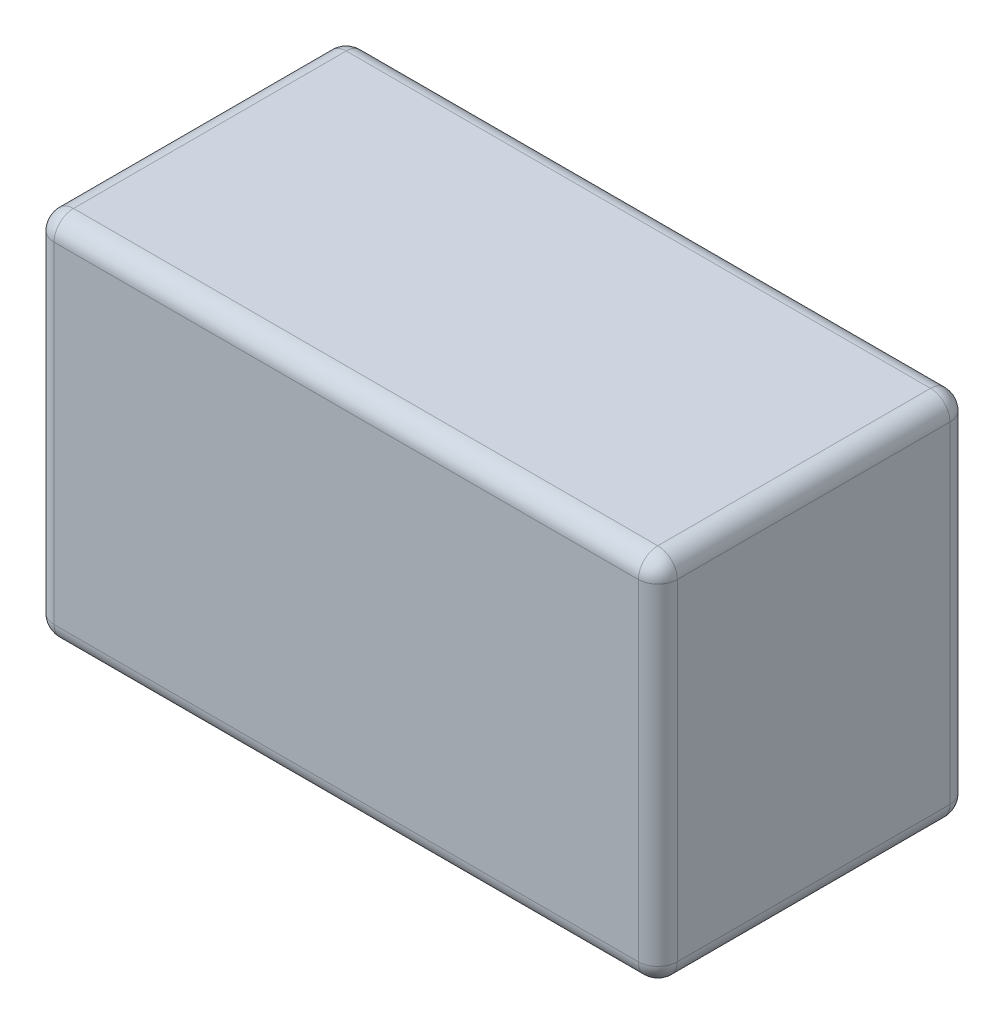
ISO-10303-21;
HEADER;
FILE_DESCRIPTION(('STEP AP214'),'2;1');
FILE_NAME('part.step','',(''),(''),'','','');
FILE_SCHEMA(('AUTOMOTIVE_DESIGN { 1 0 10303 214 1 1 1 1 }'));
ENDSEC;
DATA;
#1=APPLICATION_CONTEXT('core data for automotive mechanical design processes');
#2=APPLICATION_PROTOCOL_DEFINITION('international standard','automotive_design',2000,#1);
#3=PRODUCT_CONTEXT('',#1,'mechanical');
#4=PRODUCT('Part','Part','',(#3));
#5=PRODUCT_RELATED_PRODUCT_CATEGORY('part','',(#4));
#6=PRODUCT_DEFINITION_FORMATION('','',#4);
#7=PRODUCT_DEFINITION_CONTEXT('part definition',#1,'design');
#8=PRODUCT_DEFINITION('design','',#6,#7);
#9=PRODUCT_DEFINITION_SHAPE('','',#8);
#10=(LENGTH_UNIT() NAMED_UNIT(*) SI_UNIT(.MILLI.,.METRE.));
#11=(NAMED_UNIT(*) PLANE_ANGLE_UNIT() SI_UNIT($,.RADIAN.));
#12=(NAMED_UNIT(*) SI_UNIT($,.STERADIAN.) SOLID_ANGLE_UNIT());
#13=UNCERTAINTY_MEASURE_WITH_UNIT(LENGTH_MEASURE(1.E-05),#10,'distance_accuracy_value','');
#14=(GEOMETRIC_REPRESENTATION_CONTEXT(3) GLOBAL_UNCERTAINTY_ASSIGNED_CONTEXT((#13)) GLOBAL_UNIT_ASSIGNED_CONTEXT((#10,
#11,#12)) REPRESENTATION_CONTEXT('',''));
#15=CARTESIAN_POINT('',(0.,0.,0.));
#16=DIRECTION('',(0.,0.,1.));
#17=DIRECTION('',(1.,0.,0.));
#18=AXIS2_PLACEMENT_3D('',#15,#16,#17);
#19=CARTESIAN_POINT('',(0.75,0.9,0.35));
#20=DIRECTION('',(1.,0.,0.));
#21=DIRECTION('',(0.,0.,-1.));
#22=AXIS2_PLACEMENT_3D('',#19,#20,#21);
#23=SPHERICAL_SURFACE('',#22,0.05);
#24=CARTESIAN_POINT('',(0.75,0.9,0.35));
#25=DIRECTION('',(0.,-1.,0.));
#26=DIRECTION('',(0.,0.,-1.));
#27=AXIS2_PLACEMENT_3D('',#24,#25,#26);
#28=CIRCLE('',#27,0.05);
#29=CARTESIAN_POINT('',(0.8,0.9,0.35));
#30=VERTEX_POINT('',#29);
#31=CARTESIAN_POINT('',(0.75,0.9,0.4));
#32=VERTEX_POINT('',#31);
#33=EDGE_CURVE('E122',#30,#32,#28,.T.);
#34=ORIENTED_EDGE('',*,*,#33,.F.);
#35=CARTESIAN_POINT('',(0.75,0.9,0.35));
#36=DIRECTION('',(0.,0.,-1.));
#37=DIRECTION('',(-1.,0.,0.));
#38=AXIS2_PLACEMENT_3D('',#35,#36,#37);
#39=CIRCLE('',#38,0.05);
#40=CARTESIAN_POINT('',(0.75,0.95,0.35));
#41=VERTEX_POINT('',#40);
#42=EDGE_CURVE('E131',#41,#30,#39,.T.);
#43=ORIENTED_EDGE('',*,*,#42,.F.);
#44=CARTESIAN_POINT('',(0.75,0.9,0.35));
#45=DIRECTION('',(1.,0.,0.));
#46=DIRECTION('',(0.,0.,-1.));
#47=AXIS2_PLACEMENT_3D('',#44,#45,#46);
#48=CIRCLE('',#47,0.05);
#49=EDGE_CURVE('E111',#32,#41,#48,.F.);
#50=ORIENTED_EDGE('',*,*,#49,.F.);
#51=EDGE_LOOP('',(#34,#43,#50));
#52=FACE_BOUND('',#51,.T.);
#53=ADVANCED_FACE('F17',(#52),#23,.T.);
#54=CARTESIAN_POINT('',(-0.75,0.9,0.35));
#55=DIRECTION('',(1.,0.,0.));
#56=DIRECTION('',(0.,0.,-1.));
#57=AXIS2_PLACEMENT_3D('',#54,#55,#56);
#58=SPHERICAL_SURFACE('',#57,0.05);
#59=CARTESIAN_POINT('',(-0.75,0.9,0.35));
#60=DIRECTION('',(0.,-1.,0.));
#61=DIRECTION('',(0.,0.,-1.));
#62=AXIS2_PLACEMENT_3D('',#59,#60,#61);
#63=CIRCLE('',#62,0.05);
#64=CARTESIAN_POINT('',(-0.75,0.9,0.4));
#65=VERTEX_POINT('',#64);
#66=CARTESIAN_POINT('',(-0.8,0.9,0.35));
#67=VERTEX_POINT('',#66);
#68=EDGE_CURVE('E264',#65,#67,#63,.T.);
#69=ORIENTED_EDGE('',*,*,#68,.F.);
#70=CARTESIAN_POINT('',(-0.75,0.9,0.35));
#71=DIRECTION('',(1.,0.,0.));
#72=DIRECTION('',(0.,0.,-1.));
#73=AXIS2_PLACEMENT_3D('',#70,#71,#72);
#74=CIRCLE('',#73,0.05);
#75=CARTESIAN_POINT('',(-0.75,0.95,0.35));
#76=VERTEX_POINT('',#75);
#77=EDGE_CURVE('E114',#76,#65,#74,.T.);
#78=ORIENTED_EDGE('',*,*,#77,.F.);
#79=CARTESIAN_POINT('',(-0.75,0.9,0.35));
#80=DIRECTION('',(0.,0.,1.));
#81=DIRECTION('',(1.,0.,0.));
#82=AXIS2_PLACEMENT_3D('',#79,#80,#81);
#83=CIRCLE('',#82,0.05);
#84=EDGE_CURVE('E255',#67,#76,#83,.F.);
#85=ORIENTED_EDGE('',*,*,#84,.F.);
#86=EDGE_LOOP('',(#69,#78,#85));
#87=FACE_BOUND('',#86,.T.);
#88=ADVANCED_FACE('F151',(#87),#58,.T.);
#89=CARTESIAN_POINT('',(-0.75,0.05,0.35));
#90=DIRECTION('',(1.,0.,0.));
#91=DIRECTION('',(0.,0.,-1.));
#92=AXIS2_PLACEMENT_3D('',#89,#90,#91);
#93=SPHERICAL_SURFACE('',#92,0.05);
#94=CARTESIAN_POINT('',(-0.75,0.05,0.35));
#95=DIRECTION('',(0.,-1.,0.));
#96=DIRECTION('',(0.,0.,-1.));
#97=AXIS2_PLACEMENT_3D('',#94,#95,#96);
#98=CIRCLE('',#97,0.05);
#99=CARTESIAN_POINT('',(-0.8,0.05,0.35));
#100=VERTEX_POINT('',#99);
#101=CARTESIAN_POINT('',(-0.75,0.05,0.4));
#102=VERTEX_POINT('',#101);
#103=EDGE_CURVE('E261',#100,#102,#98,.F.);
#104=ORIENTED_EDGE('',*,*,#103,.F.);
#105=CARTESIAN_POINT('',(-0.75,0.05,0.35));
#106=DIRECTION('',(0.,0.,-1.));
#107=DIRECTION('',(-1.,0.,0.));
#108=AXIS2_PLACEMENT_3D('',#105,#106,#107);
#109=CIRCLE('',#108,0.05);
#110=CARTESIAN_POINT('',(-0.75,0.,0.35));
#111=VERTEX_POINT('',#110);
#112=EDGE_CURVE('E253',#111,#100,#109,.T.);
#113=ORIENTED_EDGE('',*,*,#112,.F.);
#114=CARTESIAN_POINT('',(-0.75,0.05,0.35));
#115=DIRECTION('',(-1.,0.,0.));
#116=DIRECTION('',(0.,0.,1.));
#117=AXIS2_PLACEMENT_3D('',#114,#115,#116);
#118=CIRCLE('',#117,0.05);
#119=EDGE_CURVE('E247',#102,#111,#118,.F.);
#120=ORIENTED_EDGE('',*,*,#119,.F.);
#121=EDGE_LOOP('',(#104,#113,#120));
#122=FACE_BOUND('',#121,.T.);
#123=ADVANCED_FACE('F147',(#122),#93,.T.);
#124=CARTESIAN_POINT('',(0.75,0.05,0.35));
#125=DIRECTION('',(1.,0.,0.));
#126=DIRECTION('',(0.,0.,-1.));
#127=AXIS2_PLACEMENT_3D('',#124,#125,#126);
#128=SPHERICAL_SURFACE('',#127,0.05);
#129=CARTESIAN_POINT('',(0.75,0.05,0.35));
#130=DIRECTION('',(-1.,0.,0.));
#131=DIRECTION('',(0.,0.,1.));
#132=AXIS2_PLACEMENT_3D('',#129,#130,#131);
#133=CIRCLE('',#132,0.05);
#134=CARTESIAN_POINT('',(0.75,0.,0.35));
#135=VERTEX_POINT('',#134);
#136=CARTESIAN_POINT('',(0.75,0.050000000000006,0.4));
#137=VERTEX_POINT('',#136);
#138=EDGE_CURVE('E245',#135,#137,#133,.T.);
#139=ORIENTED_EDGE('',*,*,#138,.F.);
#140=CARTESIAN_POINT('',(0.75,0.05,0.35));
#141=DIRECTION('',(0.,0.,1.));
#142=DIRECTION('',(1.,0.,0.));
#143=AXIS2_PLACEMENT_3D('',#140,#141,#142);
#144=CIRCLE('',#143,0.05);
#145=CARTESIAN_POINT('',(0.8,0.05,0.35));
#146=VERTEX_POINT('',#145);
#147=EDGE_CURVE('E250',#146,#135,#144,.F.);
#148=ORIENTED_EDGE('',*,*,#147,.F.);
#149=CARTESIAN_POINT('',(0.75,0.05,0.35));
#150=DIRECTION('',(0.,-1.,0.));
#151=DIRECTION('',(0.,0.,-1.));
#152=AXIS2_PLACEMENT_3D('',#149,#150,#151);
#153=CIRCLE('',#152,0.05);
#154=EDGE_CURVE('E133',#137,#146,#153,.F.);
#155=ORIENTED_EDGE('',*,*,#154,.F.);
#156=EDGE_LOOP('',(#139,#148,#155));
#157=FACE_BOUND('',#156,.T.);
#158=ADVANCED_FACE('F143',(#157),#128,.T.);
#159=CARTESIAN_POINT('',(0.75,0.95,0.35));
#160=DIRECTION('',(0.,-1.,0.));
#161=DIRECTION('',(0.,0.,-1.));
#162=AXIS2_PLACEMENT_3D('',#159,#160,#161);
#163=CYLINDRICAL_SURFACE('',#162,0.05);
#164=ORIENTED_EDGE('',*,*,#154,.T.);
#165=DIRECTION('',(0.,1.,0.));
#166=VECTOR('',#165,1.);
#167=CARTESIAN_POINT('',(0.8,0.95,0.35));
#168=LINE('',#167,#166);
#169=EDGE_CURVE('E127',#146,#30,#168,.T.);
#170=ORIENTED_EDGE('',*,*,#169,.T.);
#171=ORIENTED_EDGE('',*,*,#33,.T.);
#172=DIRECTION('',(0.,-1.,0.));
#173=VECTOR('',#172,1.);
#174=CARTESIAN_POINT('',(0.75,0.95,0.4));
#175=LINE('',#174,#173);
#176=EDGE_CURVE('E124',#32,#137,#175,.T.);
#177=ORIENTED_EDGE('',*,*,#176,.T.);
#178=EDGE_LOOP('',(#164,#170,#171,#177));
#179=FACE_BOUND('',#178,.T.);
#180=ADVANCED_FACE('F123',(#179),#163,.T.);
#181=CARTESIAN_POINT('',(0.75,0.9,-0.4));
#182=DIRECTION('',(0.,0.,-1.));
#183=DIRECTION('',(-1.,0.,0.));
#184=AXIS2_PLACEMENT_3D('',#181,#182,#183);
#185=CYLINDRICAL_SURFACE('',#184,0.05);
#186=CARTESIAN_POINT('',(0.75,0.9,-0.35));
#187=DIRECTION('',(0.,0.,1.));
#188=DIRECTION('',(1.,0.,0.));
#189=AXIS2_PLACEMENT_3D('',#186,#187,#188);
#190=CIRCLE('',#189,0.05);
#191=CARTESIAN_POINT('',(0.75,0.95,-0.35));
#192=VERTEX_POINT('',#191);
#193=CARTESIAN_POINT('',(0.8,0.9,-0.35));
#194=VERTEX_POINT('',#193);
#195=EDGE_CURVE('E236',#192,#194,#190,.F.);
#196=ORIENTED_EDGE('',*,*,#195,.F.);
#197=DIRECTION('',(0.,0.,-1.));
#198=VECTOR('',#197,1.);
#199=CARTESIAN_POINT('',(0.75,0.95,-0.4));
#200=LINE('',#199,#198);
#201=EDGE_CURVE('E116',#192,#41,#200,.F.);
#202=ORIENTED_EDGE('',*,*,#201,.T.);
#203=ORIENTED_EDGE('',*,*,#42,.T.);
#204=DIRECTION('',(0.,0.,1.));
#205=VECTOR('',#204,1.);
#206=CARTESIAN_POINT('',(0.8,0.9,0.4));
#207=LINE('',#206,#205);
#208=EDGE_CURVE('E117',#30,#194,#207,.F.);
#209=ORIENTED_EDGE('',*,*,#208,.T.);
#210=EDGE_LOOP('',(#196,#202,#203,#209));
#211=FACE_BOUND('',#210,.T.);
#212=ADVANCED_FACE('F269',(#211),#185,.T.);
#213=CARTESIAN_POINT('',(-0.75,0.95,0.35));
#214=DIRECTION('',(0.,-1.,0.));
#215=DIRECTION('',(0.,0.,-1.));
#216=AXIS2_PLACEMENT_3D('',#213,#214,#215);
#217=CYLINDRICAL_SURFACE('',#216,0.05);
#218=ORIENTED_EDGE('',*,*,#103,.T.);
#219=DIRECTION('',(0.,-1.,0.));
#220=VECTOR('',#219,1.);
#221=CARTESIAN_POINT('',(-0.75,0.95,0.4));
#222=LINE('',#221,#220);
#223=EDGE_CURVE('E258',#102,#65,#222,.F.);
#224=ORIENTED_EDGE('',*,*,#223,.T.);
#225=ORIENTED_EDGE('',*,*,#68,.T.);
#226=DIRECTION('',(0.,1.,0.));
#227=VECTOR('',#226,1.);
#228=CARTESIAN_POINT('',(-0.8,0.95,0.35));
#229=LINE('',#228,#227);
#230=EDGE_CURVE('E353',#67,#100,#229,.F.);
#231=ORIENTED_EDGE('',*,*,#230,.T.);
#232=EDGE_LOOP('',(#218,#224,#225,#231));
#233=FACE_BOUND('',#232,.T.);
#234=ADVANCED_FACE('F358',(#233),#217,.T.);
#235=CARTESIAN_POINT('',(-0.75,0.9,-0.4));
#236=DIRECTION('',(0.,0.,1.));
#237=DIRECTION('',(1.,0.,0.));
#238=AXIS2_PLACEMENT_3D('',#235,#236,#237);
#239=CYLINDRICAL_SURFACE('',#238,0.05);
#240=CARTESIAN_POINT('',(-0.75,0.9,-0.35));
#241=DIRECTION('',(0.,3.83299520255585E-12,1.));
#242=DIRECTION('',(1.,0.,0.));
#243=AXIS2_PLACEMENT_3D('',#240,#241,#242);
#244=CIRCLE('',#243,0.05);
#245=CARTESIAN_POINT('',(-0.8,0.9,-0.35));
#246=VERTEX_POINT('',#245);
#247=CARTESIAN_POINT('',(-0.75,0.95,-0.350000000000024));
#248=VERTEX_POINT('',#247);
#249=EDGE_CURVE('E213',#246,#248,#244,.F.);
#250=ORIENTED_EDGE('',*,*,#249,.F.);
#251=DIRECTION('',(0.,0.,-1.));
#252=VECTOR('',#251,1.);
#253=CARTESIAN_POINT('',(-0.8,0.9,0.4));
#254=LINE('',#253,#252);
#255=EDGE_CURVE('E355',#246,#67,#254,.F.);
#256=ORIENTED_EDGE('',*,*,#255,.T.);
#257=ORIENTED_EDGE('',*,*,#84,.T.);
#258=DIRECTION('',(0.,0.,-1.));
#259=VECTOR('',#258,1.);
#260=CARTESIAN_POINT('',(-0.75,0.95,-0.4));
#261=LINE('',#260,#259);
#262=EDGE_CURVE('E234',#76,#248,#261,.T.);
#263=ORIENTED_EDGE('',*,*,#262,.T.);
#264=EDGE_LOOP('',(#250,#256,#257,#263));
#265=FACE_BOUND('',#264,.T.);
#266=ADVANCED_FACE('F361',(#265),#239,.T.);
#267=CARTESIAN_POINT('',(-0.75,0.05,0.4));
#268=DIRECTION('',(0.,0.,-1.));
#269=DIRECTION('',(-1.,0.,0.));
#270=AXIS2_PLACEMENT_3D('',#267,#268,#269);
#271=CYLINDRICAL_SURFACE('',#270,0.05);
#272=CARTESIAN_POINT('',(-0.75,0.05,-0.35));
#273=DIRECTION('',(0.,0.,-1.));
#274=DIRECTION('',(1.,0.,0.));
#275=AXIS2_PLACEMENT_3D('',#272,#273,#274);
#276=CIRCLE('',#275,0.05);
#277=CARTESIAN_POINT('',(-0.75,0.,-0.35));
#278=VERTEX_POINT('',#277);
#279=CARTESIAN_POINT('',(-0.8,0.05,-0.35));
#280=VERTEX_POINT('',#279);
#281=EDGE_CURVE('E209',#278,#280,#276,.T.);
#282=ORIENTED_EDGE('',*,*,#281,.F.);
#283=DIRECTION('',(0.,0.,-1.));
#284=VECTOR('',#283,1.);
#285=CARTESIAN_POINT('',(-0.75,0.,-0.4));
#286=LINE('',#285,#284);
#287=EDGE_CURVE('E205',#111,#278,#286,.T.);
#288=ORIENTED_EDGE('',*,*,#287,.F.);
#289=ORIENTED_EDGE('',*,*,#112,.T.);
#290=DIRECTION('',(0.,0.,-1.));
#291=VECTOR('',#290,1.);
#292=CARTESIAN_POINT('',(-0.8,0.05,0.4));
#293=LINE('',#292,#291);
#294=EDGE_CURVE('E307',#100,#280,#293,.T.);
#295=ORIENTED_EDGE('',*,*,#294,.T.);
#296=EDGE_LOOP('',(#282,#288,#289,#295));
#297=FACE_BOUND('',#296,.T.);
#298=ADVANCED_FACE('F305',(#297),#271,.T.);
#299=CARTESIAN_POINT('',(0.75,0.05,0.4));
#300=DIRECTION('',(0.,0.,1.));
#301=DIRECTION('',(1.,0.,0.));
#302=AXIS2_PLACEMENT_3D('',#299,#300,#301);
#303=CYLINDRICAL_SURFACE('',#302,0.05);
#304=CARTESIAN_POINT('',(0.75,0.05,-0.35));
#305=DIRECTION('',(0.,0.,-1.));
#306=DIRECTION('',(1.,0.,0.));
#307=AXIS2_PLACEMENT_3D('',#304,#305,#306);
#308=CIRCLE('',#307,0.05);
#309=CARTESIAN_POINT('',(0.8,0.05,-0.35));
#310=VERTEX_POINT('',#309);
#311=CARTESIAN_POINT('',(0.75,0.,-0.35));
#312=VERTEX_POINT('',#311);
#313=EDGE_CURVE('E207',#310,#312,#308,.T.);
#314=ORIENTED_EDGE('',*,*,#313,.F.);
#315=DIRECTION('',(0.,0.,1.));
#316=VECTOR('',#315,1.);
#317=CARTESIAN_POINT('',(0.8,0.05,0.4));
#318=LINE('',#317,#316);
#319=EDGE_CURVE('E242',#310,#146,#318,.T.);
#320=ORIENTED_EDGE('',*,*,#319,.T.);
#321=ORIENTED_EDGE('',*,*,#147,.T.);
#322=DIRECTION('',(0.,0.,-1.));
#323=VECTOR('',#322,1.);
#324=CARTESIAN_POINT('',(0.75,0.,-0.4));
#325=LINE('',#324,#323);
#326=EDGE_CURVE('E294',#312,#135,#325,.F.);
#327=ORIENTED_EDGE('',*,*,#326,.F.);
#328=EDGE_LOOP('',(#314,#320,#321,#327));
#329=FACE_BOUND('',#328,.T.);
#330=ADVANCED_FACE('F344',(#329),#303,.T.);
#331=CARTESIAN_POINT('',(-0.8,0.95,0.4));
#332=DIRECTION('',(0.,0.,-1.));
#333=DIRECTION('',(-1.,0.,0.));
#334=AXIS2_PLACEMENT_3D('',#331,#332,#333);
#335=PLANE('',#334);
#336=DIRECTION('',(1.,0.,0.));
#337=VECTOR('',#336,1.);
#338=CARTESIAN_POINT('',(0.8,0.9,0.4));
#339=LINE('',#338,#337);
#340=EDGE_CURVE('E107',#65,#32,#339,.T.);
#341=ORIENTED_EDGE('',*,*,#340,.F.);
#342=ORIENTED_EDGE('',*,*,#223,.F.);
#343=DIRECTION('',(-1.,0.,0.));
#344=VECTOR('',#343,1.);
#345=CARTESIAN_POINT('',(-0.8,0.05,0.4));
#346=LINE('',#345,#344);
#347=EDGE_CURVE('E101',#137,#102,#346,.T.);
#348=ORIENTED_EDGE('',*,*,#347,.F.);
#349=ORIENTED_EDGE('',*,*,#176,.F.);
#350=EDGE_LOOP('',(#341,#342,#348,#349));
#351=FACE_BOUND('',#350,.T.);
#352=ADVANCED_FACE('F135',(#351),#335,.F.);
#353=CARTESIAN_POINT('',(0.8,0.95,0.4));
#354=DIRECTION('',(-1.,0.,0.));
#355=DIRECTION('',(0.,0.,1.));
#356=AXIS2_PLACEMENT_3D('',#353,#354,#355);
#357=PLANE('',#356);
#358=ORIENTED_EDGE('',*,*,#208,.F.);
#359=ORIENTED_EDGE('',*,*,#169,.F.);
#360=ORIENTED_EDGE('',*,*,#319,.F.);
#361=DIRECTION('',(0.,-1.,0.));
#362=VECTOR('',#361,1.);
#363=CARTESIAN_POINT('',(0.8,0.95,-0.35));
#364=LINE('',#363,#362);
#365=EDGE_CURVE('E285',#194,#310,#364,.T.);
#366=ORIENTED_EDGE('',*,*,#365,.F.);
#367=EDGE_LOOP('',(#358,#359,#360,#366));
#368=FACE_BOUND('',#367,.T.);
#369=ADVANCED_FACE('F440',(#368),#357,.F.);
#370=CARTESIAN_POINT('',(0.8,0.9,0.35));
#371=DIRECTION('',(1.,0.,0.));
#372=DIRECTION('',(0.,0.,-1.));
#373=AXIS2_PLACEMENT_3D('',#370,#371,#372);
#374=CYLINDRICAL_SURFACE('',#373,0.05);
#375=ORIENTED_EDGE('',*,*,#340,.T.);
#376=ORIENTED_EDGE('',*,*,#49,.T.);
#377=DIRECTION('',(1.,0.,0.));
#378=VECTOR('',#377,1.);
#379=CARTESIAN_POINT('',(0.8,0.95,0.35));
#380=LINE('',#379,#378);
#381=EDGE_CURVE('E276',#41,#76,#380,.F.);
#382=ORIENTED_EDGE('',*,*,#381,.T.);
#383=ORIENTED_EDGE('',*,*,#77,.T.);
#384=EDGE_LOOP('',(#375,#376,#382,#383));
#385=FACE_BOUND('',#384,.T.);
#386=ADVANCED_FACE('F109',(#385),#374,.T.);
#387=CARTESIAN_POINT('',(0.75,0.9,-0.35));
#388=DIRECTION('',(1.,0.,0.));
#389=DIRECTION('',(0.,0.,-1.));
#390=AXIS2_PLACEMENT_3D('',#387,#388,#389);
#391=SPHERICAL_SURFACE('',#390,0.05);
#392=ORIENTED_EDGE('',*,*,#195,.T.);
#393=CARTESIAN_POINT('',(0.75,0.9,-0.35));
#394=DIRECTION('',(0.,-1.,0.));
#395=DIRECTION('',(0.,0.,-1.));
#396=AXIS2_PLACEMENT_3D('',#393,#394,#395);
#397=CIRCLE('',#396,0.05);
#398=CARTESIAN_POINT('',(0.75,0.9,-0.4));
#399=VERTEX_POINT('',#398);
#400=EDGE_CURVE('E291',#399,#194,#397,.T.);
#401=ORIENTED_EDGE('',*,*,#400,.F.);
#402=CARTESIAN_POINT('',(0.75,0.9,-0.35));
#403=DIRECTION('',(-1.,0.,0.));
#404=DIRECTION('',(0.,0.,1.));
#405=AXIS2_PLACEMENT_3D('',#402,#403,#404);
#406=CIRCLE('',#405,0.05);
#407=EDGE_CURVE('E278',#192,#399,#406,.T.);
#408=ORIENTED_EDGE('',*,*,#407,.F.);
#409=EDGE_LOOP('',(#392,#401,#408));
#410=FACE_BOUND('',#409,.T.);
#411=ADVANCED_FACE('F224',(#410),#391,.T.);
#412=CARTESIAN_POINT('',(-0.8,0.95,0.4));
#413=DIRECTION('',(1.,0.,0.));
#414=DIRECTION('',(0.,0.,-1.));
#415=AXIS2_PLACEMENT_3D('',#412,#413,#414);
#416=PLANE('',#415);
#417=ORIENTED_EDGE('',*,*,#255,.F.);
#418=DIRECTION('',(0.,-1.,0.));
#419=VECTOR('',#418,1.);
#420=CARTESIAN_POINT('',(-0.8,0.95,-0.35));
#421=LINE('',#420,#419);
#422=EDGE_CURVE('E321',#280,#246,#421,.F.);
#423=ORIENTED_EDGE('',*,*,#422,.F.);
#424=ORIENTED_EDGE('',*,*,#294,.F.);
#425=ORIENTED_EDGE('',*,*,#230,.F.);
#426=EDGE_LOOP('',(#417,#423,#424,#425));
#427=FACE_BOUND('',#426,.T.);
#428=ADVANCED_FACE('F220',(#427),#416,.F.);
#429=CARTESIAN_POINT('',(-0.75,0.9,-0.35));
#430=DIRECTION('',(1.,0.,0.));
#431=DIRECTION('',(0.,0.,-1.));
#432=AXIS2_PLACEMENT_3D('',#429,#430,#431);
#433=SPHERICAL_SURFACE('',#432,0.05);
#434=ORIENTED_EDGE('',*,*,#249,.T.);
#435=CARTESIAN_POINT('',(-0.75,0.9,-0.35));
#436=DIRECTION('',(-1.,0.,0.));
#437=DIRECTION('',(0.,0.,1.));
#438=AXIS2_PLACEMENT_3D('',#435,#436,#437);
#439=CIRCLE('',#438,0.05);
#440=CARTESIAN_POINT('',(-0.75,0.9,-0.4));
#441=VERTEX_POINT('',#440);
#442=EDGE_CURVE('E282',#441,#248,#439,.F.);
#443=ORIENTED_EDGE('',*,*,#442,.F.);
#444=CARTESIAN_POINT('',(-0.75,0.9,-0.35));
#445=DIRECTION('',(0.,-1.,0.));
#446=DIRECTION('',(0.,0.,-1.));
#447=AXIS2_PLACEMENT_3D('',#444,#445,#446);
#448=CIRCLE('',#447,0.05);
#449=EDGE_CURVE('E316',#246,#441,#448,.T.);
#450=ORIENTED_EDGE('',*,*,#449,.F.);
#451=EDGE_LOOP('',(#434,#443,#450));
#452=FACE_BOUND('',#451,.T.);
#453=ADVANCED_FACE('F217',(#452),#433,.T.);
#454=CARTESIAN_POINT('',(-0.75,0.05,-0.35));
#455=DIRECTION('',(1.,0.,0.));
#456=DIRECTION('',(0.,0.,-1.));
#457=AXIS2_PLACEMENT_3D('',#454,#455,#456);
#458=SPHERICAL_SURFACE('',#457,0.05);
#459=CARTESIAN_POINT('',(-0.75,0.05,-0.35));
#460=DIRECTION('',(0.,-1.,0.));
#461=DIRECTION('',(0.,0.,-1.));
#462=AXIS2_PLACEMENT_3D('',#459,#460,#461);
#463=CIRCLE('',#462,0.05);
#464=CARTESIAN_POINT('',(-0.75,0.05,-0.4));
#465=VERTEX_POINT('',#464);
#466=EDGE_CURVE('E313',#465,#280,#463,.F.);
#467=ORIENTED_EDGE('',*,*,#466,.F.);
#468=CARTESIAN_POINT('',(-0.75,0.05,-0.35));
#469=DIRECTION('',(1.,0.,0.));
#470=DIRECTION('',(0.,0.,-1.));
#471=AXIS2_PLACEMENT_3D('',#468,#469,#470);
#472=CIRCLE('',#471,0.05);
#473=EDGE_CURVE('E312',#278,#465,#472,.T.);
#474=ORIENTED_EDGE('',*,*,#473,.F.);
#475=ORIENTED_EDGE('',*,*,#281,.T.);
#476=EDGE_LOOP('',(#467,#474,#475));
#477=FACE_BOUND('',#476,.T.);
#478=ADVANCED_FACE('F198',(#477),#458,.T.);
#479=CARTESIAN_POINT('',(0.75,0.05,-0.35));
#480=DIRECTION('',(1.,0.,0.));
#481=DIRECTION('',(0.,0.,-1.));
#482=AXIS2_PLACEMENT_3D('',#479,#480,#481);
#483=SPHERICAL_SURFACE('',#482,0.05);
#484=CARTESIAN_POINT('',(0.75,0.05,-0.35));
#485=DIRECTION('',(1.,0.,0.));
#486=DIRECTION('',(0.,0.,-1.));
#487=AXIS2_PLACEMENT_3D('',#484,#485,#486);
#488=CIRCLE('',#487,0.05);
#489=CARTESIAN_POINT('',(0.75,0.05,-0.4));
#490=VERTEX_POINT('',#489);
#491=EDGE_CURVE('E315',#490,#312,#488,.F.);
#492=ORIENTED_EDGE('',*,*,#491,.F.);
#493=CARTESIAN_POINT('',(0.75,0.05,-0.35));
#494=DIRECTION('',(0.,-1.,0.));
#495=DIRECTION('',(0.,0.,-1.));
#496=AXIS2_PLACEMENT_3D('',#493,#494,#495);
#497=CIRCLE('',#496,0.05);
#498=EDGE_CURVE('E279',#310,#490,#497,.F.);
#499=ORIENTED_EDGE('',*,*,#498,.F.);
#500=ORIENTED_EDGE('',*,*,#313,.T.);
#501=EDGE_LOOP('',(#492,#499,#500));
#502=FACE_BOUND('',#501,.T.);
#503=ADVANCED_FACE('F193',(#502),#483,.T.);
#504=CARTESIAN_POINT('',(-0.8,0.05,0.35));
#505=DIRECTION('',(-1.,0.,0.));
#506=DIRECTION('',(0.,0.,1.));
#507=AXIS2_PLACEMENT_3D('',#504,#505,#506);
#508=CYLINDRICAL_SURFACE('',#507,0.05);
#509=DIRECTION('',(1.,0.,0.));
#510=VECTOR('',#509,1.);
#511=CARTESIAN_POINT('',(0.8,0.,0.35));
#512=LINE('',#511,#510);
#513=EDGE_CURVE('E301',#135,#111,#512,.F.);
#514=ORIENTED_EDGE('',*,*,#513,.F.);
#515=ORIENTED_EDGE('',*,*,#138,.T.);
#516=ORIENTED_EDGE('',*,*,#347,.T.);
#517=ORIENTED_EDGE('',*,*,#119,.T.);
#518=EDGE_LOOP('',(#514,#515,#516,#517));
#519=FACE_BOUND('',#518,.T.);
#520=ADVANCED_FACE('F189',(#519),#508,.T.);
#521=CARTESIAN_POINT('',(0.75,0.95,-0.35));
#522=DIRECTION('',(0.,-1.,0.));
#523=DIRECTION('',(0.,0.,-1.));
#524=AXIS2_PLACEMENT_3D('',#521,#522,#523);
#525=CYLINDRICAL_SURFACE('',#524,0.05);
#526=ORIENTED_EDGE('',*,*,#498,.T.);
#527=DIRECTION('',(0.,1.,0.));
#528=VECTOR('',#527,1.);
#529=CARTESIAN_POINT('',(0.75,0.95,-0.4));
#530=LINE('',#529,#528);
#531=EDGE_CURVE('E334',#490,#399,#530,.T.);
#532=ORIENTED_EDGE('',*,*,#531,.T.);
#533=ORIENTED_EDGE('',*,*,#400,.T.);
#534=ORIENTED_EDGE('',*,*,#365,.T.);
#535=EDGE_LOOP('',(#526,#532,#533,#534));
#536=FACE_BOUND('',#535,.T.);
#537=ADVANCED_FACE('F185',(#536),#525,.T.);
#538=CARTESIAN_POINT('',(0.8,0.95,-0.4));
#539=DIRECTION('',(0.,-1.,0.));
#540=DIRECTION('',(0.,0.,-1.));
#541=AXIS2_PLACEMENT_3D('',#538,#539,#540);
#542=PLANE('',#541);
#543=DIRECTION('',(-1.,0.,0.));
#544=VECTOR('',#543,1.);
#545=CARTESIAN_POINT('',(0.8,0.95,-0.35));
#546=LINE('',#545,#544);
#547=EDGE_CURVE('E274',#248,#192,#546,.F.);
#548=ORIENTED_EDGE('',*,*,#547,.F.);
#549=ORIENTED_EDGE('',*,*,#262,.F.);
#550=ORIENTED_EDGE('',*,*,#381,.F.);
#551=ORIENTED_EDGE('',*,*,#201,.F.);
#552=EDGE_LOOP('',(#548,#549,#550,#551));
#553=FACE_BOUND('',#552,.T.);
#554=ADVANCED_FACE('F181',(#553),#542,.F.);
#555=CARTESIAN_POINT('',(-0.75,0.95,-0.35));
#556=DIRECTION('',(0.,-1.,0.));
#557=DIRECTION('',(0.,0.,-1.));
#558=AXIS2_PLACEMENT_3D('',#555,#556,#557);
#559=CYLINDRICAL_SURFACE('',#558,0.05);
#560=ORIENTED_EDGE('',*,*,#449,.T.);
#561=DIRECTION('',(0.,1.,0.));
#562=VECTOR('',#561,1.);
#563=CARTESIAN_POINT('',(-0.75,0.95,-0.4));
#564=LINE('',#563,#562);
#565=EDGE_CURVE('E331',#441,#465,#564,.F.);
#566=ORIENTED_EDGE('',*,*,#565,.T.);
#567=ORIENTED_EDGE('',*,*,#466,.T.);
#568=ORIENTED_EDGE('',*,*,#422,.T.);
#569=EDGE_LOOP('',(#560,#566,#567,#568));
#570=FACE_BOUND('',#569,.T.);
#571=ADVANCED_FACE('F177',(#570),#559,.T.);
#572=CARTESIAN_POINT('',(0.8,0.,-0.4));
#573=DIRECTION('',(0.,-1.,0.));
#574=DIRECTION('',(0.,0.,-1.));
#575=AXIS2_PLACEMENT_3D('',#572,#573,#574);
#576=PLANE('',#575);
#577=DIRECTION('',(1.,0.,0.));
#578=VECTOR('',#577,1.);
#579=CARTESIAN_POINT('',(-0.8,0.,-0.35));
#580=LINE('',#579,#578);
#581=EDGE_CURVE('E300',#312,#278,#580,.F.);
#582=ORIENTED_EDGE('',*,*,#581,.F.);
#583=ORIENTED_EDGE('',*,*,#326,.T.);
#584=ORIENTED_EDGE('',*,*,#513,.T.);
#585=ORIENTED_EDGE('',*,*,#287,.T.);
#586=EDGE_LOOP('',(#582,#583,#584,#585));
#587=FACE_BOUND('',#586,.T.);
#588=ADVANCED_FACE('F173',(#587),#576,.T.);
#589=CARTESIAN_POINT('',(0.8,0.9,-0.35));
#590=DIRECTION('',(-1.,0.,0.));
#591=DIRECTION('',(0.,0.,1.));
#592=AXIS2_PLACEMENT_3D('',#589,#590,#591);
#593=CYLINDRICAL_SURFACE('',#592,0.05);
#594=ORIENTED_EDGE('',*,*,#547,.T.);
#595=ORIENTED_EDGE('',*,*,#407,.T.);
#596=DIRECTION('',(1.,0.,0.));
#597=VECTOR('',#596,1.);
#598=CARTESIAN_POINT('',(-0.8,0.9,-0.4));
#599=LINE('',#598,#597);
#600=EDGE_CURVE('E26',#399,#441,#599,.F.);
#601=ORIENTED_EDGE('',*,*,#600,.T.);
#602=ORIENTED_EDGE('',*,*,#442,.T.);
#603=EDGE_LOOP('',(#594,#595,#601,#602));
#604=FACE_BOUND('',#603,.T.);
#605=ADVANCED_FACE('F167',(#604),#593,.T.);
#606=CARTESIAN_POINT('',(-0.8,0.05,-0.35));
#607=DIRECTION('',(1.,0.,0.));
#608=DIRECTION('',(0.,0.,-1.));
#609=AXIS2_PLACEMENT_3D('',#606,#607,#608);
#610=CYLINDRICAL_SURFACE('',#609,0.05);
#611=DIRECTION('',(1.,0.,0.));
#612=VECTOR('',#611,1.);
#613=CARTESIAN_POINT('',(-0.8,0.05,-0.4));
#614=LINE('',#613,#612);
#615=EDGE_CURVE('E11',#465,#490,#614,.T.);
#616=ORIENTED_EDGE('',*,*,#615,.T.);
#617=ORIENTED_EDGE('',*,*,#491,.T.);
#618=ORIENTED_EDGE('',*,*,#581,.T.);
#619=ORIENTED_EDGE('',*,*,#473,.T.);
#620=EDGE_LOOP('',(#616,#617,#618,#619));
#621=FACE_BOUND('',#620,.T.);
#622=ADVANCED_FACE('F162',(#621),#610,.T.);
#623=CARTESIAN_POINT('',(-0.8,0.95,-0.4));
#624=DIRECTION('',(0.,0.,1.));
#625=DIRECTION('',(1.,0.,0.));
#626=AXIS2_PLACEMENT_3D('',#623,#624,#625);
#627=PLANE('',#626);
#628=ORIENTED_EDGE('',*,*,#615,.F.);
#629=ORIENTED_EDGE('',*,*,#565,.F.);
#630=ORIENTED_EDGE('',*,*,#600,.F.);
#631=ORIENTED_EDGE('',*,*,#531,.F.);
#632=EDGE_LOOP('',(#628,#629,#630,#631));
#633=FACE_BOUND('',#632,.T.);
#634=ADVANCED_FACE('F160',(#633),#627,.F.);
#635=CLOSED_SHELL('',(#53,#88,#123,#158,#180,#212,#234,#266,#298,#330,#352,#369,#386,#411,#428,
#453,#478,#503,#520,#537,#554,#571,#588,#605,#622,#634));
#636=MANIFOLD_SOLID_BREP('B1',#635);
#637=ADVANCED_BREP_SHAPE_REPRESENTATION('',(#18,#636),#14);
#638=SHAPE_DEFINITION_REPRESENTATION(#9,#637);
ENDSEC;
END-ISO-10303-21;
